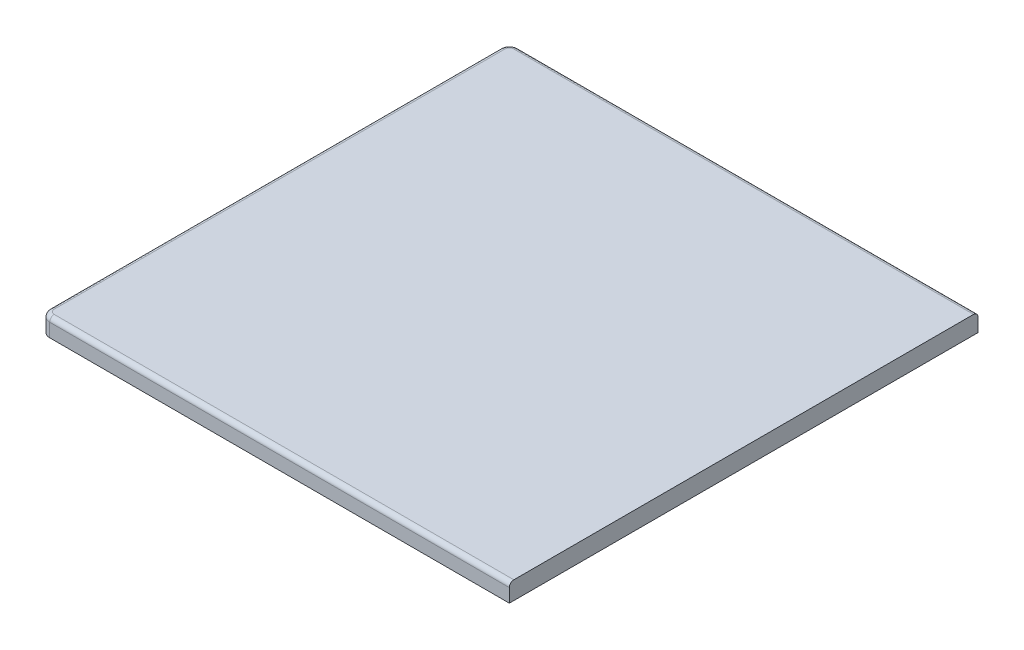
ISO-10303-21;
HEADER;
FILE_DESCRIPTION(('STEP AP214'),'2;1');
FILE_NAME('part.step','',(''),(''),'','','');
FILE_SCHEMA(('AUTOMOTIVE_DESIGN { 1 0 10303 214 1 1 1 1 }'));
ENDSEC;
DATA;
#1=APPLICATION_CONTEXT('core data for automotive mechanical design processes');
#2=APPLICATION_PROTOCOL_DEFINITION('international standard','automotive_design',2000,#1);
#3=PRODUCT_CONTEXT('',#1,'mechanical');
#4=PRODUCT('Part','Part','',(#3));
#5=PRODUCT_RELATED_PRODUCT_CATEGORY('part','',(#4));
#6=PRODUCT_DEFINITION_FORMATION('','',#4);
#7=PRODUCT_DEFINITION_CONTEXT('part definition',#1,'design');
#8=PRODUCT_DEFINITION('design','',#6,#7);
#9=PRODUCT_DEFINITION_SHAPE('','',#8);
#10=(LENGTH_UNIT() NAMED_UNIT(*) SI_UNIT(.MILLI.,.METRE.));
#11=(NAMED_UNIT(*) PLANE_ANGLE_UNIT() SI_UNIT($,.RADIAN.));
#12=(NAMED_UNIT(*) SI_UNIT($,.STERADIAN.) SOLID_ANGLE_UNIT());
#13=UNCERTAINTY_MEASURE_WITH_UNIT(LENGTH_MEASURE(1.E-05),#10,'distance_accuracy_value','');
#14=(GEOMETRIC_REPRESENTATION_CONTEXT(3) GLOBAL_UNCERTAINTY_ASSIGNED_CONTEXT((#13)) GLOBAL_UNIT_ASSIGNED_CONTEXT((#10,
#11,#12)) REPRESENTATION_CONTEXT('',''));
#15=CARTESIAN_POINT('',(0.,0.,0.));
#16=DIRECTION('',(0.,0.,1.));
#17=DIRECTION('',(1.,0.,0.));
#18=AXIS2_PLACEMENT_3D('',#15,#16,#17);
#19=CARTESIAN_POINT('',(0.,4.,0.));
#20=DIRECTION('',(0.,1.,0.));
#21=DIRECTION('',(0.,0.,1.));
#22=AXIS2_PLACEMENT_3D('',#19,#20,#21);
#23=PLANE('',#22);
#24=CARTESIAN_POINT('',(-50.,4.,-50.));
#25=DIRECTION('',(0.,1.,0.));
#26=DIRECTION('',(0.,0.,1.));
#27=AXIS2_PLACEMENT_3D('',#24,#25,#26);
#28=CIRCLE('',#27,1.);
#29=CARTESIAN_POINT('',(-51.,4.,-50.));
#30=VERTEX_POINT('',#29);
#31=CARTESIAN_POINT('',(-50.,4.,-51.));
#32=VERTEX_POINT('',#31);
#33=EDGE_CURVE('E209',#30,#32,#28,.F.);
#34=ORIENTED_EDGE('',*,*,#33,.F.);
#35=DIRECTION('',(0.,0.,1.));
#36=VECTOR('',#35,1.);
#37=CARTESIAN_POINT('',(-51.,4.,52.));
#38=LINE('',#37,#36);
#39=CARTESIAN_POINT('',(-51.,4.,50.));
#40=VERTEX_POINT('',#39);
#41=EDGE_CURVE('E187',#30,#40,#38,.T.);
#42=ORIENTED_EDGE('',*,*,#41,.T.);
#43=CARTESIAN_POINT('',(-50.,4.,50.));
#44=DIRECTION('',(0.,1.,0.));
#45=DIRECTION('',(0.,0.,1.));
#46=AXIS2_PLACEMENT_3D('',#43,#44,#45);
#47=CIRCLE('',#46,1.);
#48=CARTESIAN_POINT('',(-50.,4.,51.));
#49=VERTEX_POINT('',#48);
#50=EDGE_CURVE('E207',#49,#40,#47,.F.);
#51=ORIENTED_EDGE('',*,*,#50,.F.);
#52=DIRECTION('',(1.,0.,0.));
#53=VECTOR('',#52,1.);
#54=CARTESIAN_POINT('',(52.,4.,51.));
#55=LINE('',#54,#53);
#56=CARTESIAN_POINT('',(52.,4.,51.));
#57=VERTEX_POINT('',#56);
#58=EDGE_CURVE('E190',#49,#57,#55,.T.);
#59=ORIENTED_EDGE('',*,*,#58,.T.);
#60=DIRECTION('',(0.,0.,-1.));
#61=VECTOR('',#60,1.);
#62=CARTESIAN_POINT('',(52.,4.,52.));
#63=LINE('',#62,#61);
#64=CARTESIAN_POINT('',(52.,4.,-51.));
#65=VERTEX_POINT('',#64);
#66=EDGE_CURVE('E170',#57,#65,#63,.T.);
#67=ORIENTED_EDGE('',*,*,#66,.T.);
#68=DIRECTION('',(-1.,0.,0.));
#69=VECTOR('',#68,1.);
#70=CARTESIAN_POINT('',(-52.,4.,-51.));
#71=LINE('',#70,#69);
#72=EDGE_CURVE('E184',#65,#32,#71,.T.);
#73=ORIENTED_EDGE('',*,*,#72,.T.);
#74=EDGE_LOOP('',(#34,#42,#51,#59,#67,#73));
#75=FACE_BOUND('',#74,.T.);
#76=ADVANCED_FACE('F40',(#75),#23,.T.);
#77=CARTESIAN_POINT('',(0.,0.,0.));
#78=DIRECTION('',(0.,1.,0.));
#79=DIRECTION('',(0.,0.,1.));
#80=AXIS2_PLACEMENT_3D('',#77,#78,#79);
#81=PLANE('',#80);
#82=DIRECTION('',(1.,0.,0.));
#83=VECTOR('',#82,1.);
#84=CARTESIAN_POINT('',(52.,0.,52.));
#85=LINE('',#84,#83);
#86=CARTESIAN_POINT('',(-50.,0.,52.));
#87=VERTEX_POINT('',#86);
#88=CARTESIAN_POINT('',(52.,0.,52.));
#89=VERTEX_POINT('',#88);
#90=EDGE_CURVE('E164',#87,#89,#85,.T.);
#91=ORIENTED_EDGE('',*,*,#90,.F.);
#92=CARTESIAN_POINT('',(-50.,0.,50.));
#93=DIRECTION('',(0.,1.,0.));
#94=DIRECTION('',(0.,0.,1.));
#95=AXIS2_PLACEMENT_3D('',#92,#93,#94);
#96=CIRCLE('',#95,2.);
#97=CARTESIAN_POINT('',(-52.,0.,50.));
#98=VERTEX_POINT('',#97);
#99=EDGE_CURVE('E63',#87,#98,#96,.F.);
#100=ORIENTED_EDGE('',*,*,#99,.T.);
#101=DIRECTION('',(0.,0.,1.));
#102=VECTOR('',#101,1.);
#103=CARTESIAN_POINT('',(-52.,0.,52.));
#104=LINE('',#103,#102);
#105=CARTESIAN_POINT('',(-52.,0.,-50.));
#106=VERTEX_POINT('',#105);
#107=EDGE_CURVE('E161',#106,#98,#104,.T.);
#108=ORIENTED_EDGE('',*,*,#107,.F.);
#109=CARTESIAN_POINT('',(-50.,0.,-50.));
#110=DIRECTION('',(0.,1.,0.));
#111=DIRECTION('',(0.,0.,1.));
#112=AXIS2_PLACEMENT_3D('',#109,#110,#111);
#113=CIRCLE('',#112,2.);
#114=CARTESIAN_POINT('',(-50.,0.,-52.));
#115=VERTEX_POINT('',#114);
#116=EDGE_CURVE('E57',#106,#115,#113,.F.);
#117=ORIENTED_EDGE('',*,*,#116,.T.);
#118=DIRECTION('',(-1.,0.,0.));
#119=VECTOR('',#118,1.);
#120=CARTESIAN_POINT('',(52.,0.,-52.));
#121=LINE('',#120,#119);
#122=CARTESIAN_POINT('',(52.,0.,-52.));
#123=VERTEX_POINT('',#122);
#124=EDGE_CURVE('E173',#123,#115,#121,.T.);
#125=ORIENTED_EDGE('',*,*,#124,.F.);
#126=DIRECTION('',(0.,0.,-1.));
#127=VECTOR('',#126,1.);
#128=CARTESIAN_POINT('',(52.,0.,52.));
#129=LINE('',#128,#127);
#130=EDGE_CURVE('E176',#89,#123,#129,.T.);
#131=ORIENTED_EDGE('',*,*,#130,.F.);
#132=EDGE_LOOP('',(#91,#100,#108,#117,#125,#131));
#133=FACE_BOUND('',#132,.T.);
#134=DIRECTION('',(-1.,0.,0.));
#135=VECTOR('',#134,1.);
#136=CARTESIAN_POINT('',(50.,0.,-50.));
#137=LINE('',#136,#135);
#138=CARTESIAN_POINT('',(50.,0.,-50.));
#139=VERTEX_POINT('',#138);
#140=CARTESIAN_POINT('',(-50.,0.,-50.));
#141=VERTEX_POINT('',#140);
#142=EDGE_CURVE('E226',#139,#141,#137,.T.);
#143=ORIENTED_EDGE('',*,*,#142,.T.);
#144=DIRECTION('',(0.,0.,1.));
#145=VECTOR('',#144,1.);
#146=CARTESIAN_POINT('',(-50.,0.,-50.));
#147=LINE('',#146,#145);
#148=CARTESIAN_POINT('',(-50.,0.,50.));
#149=VERTEX_POINT('',#148);
#150=EDGE_CURVE('E160',#141,#149,#147,.T.);
#151=ORIENTED_EDGE('',*,*,#150,.T.);
#152=DIRECTION('',(1.,0.,0.));
#153=VECTOR('',#152,1.);
#154=CARTESIAN_POINT('',(-50.,0.,50.));
#155=LINE('',#154,#153);
#156=CARTESIAN_POINT('',(50.,0.,50.));
#157=VERTEX_POINT('',#156);
#158=EDGE_CURVE('E427',#149,#157,#155,.T.);
#159=ORIENTED_EDGE('',*,*,#158,.T.);
#160=DIRECTION('',(0.,0.,-1.));
#161=VECTOR('',#160,1.);
#162=CARTESIAN_POINT('',(50.,0.,50.));
#163=LINE('',#162,#161);
#164=EDGE_CURVE('E156',#157,#139,#163,.T.);
#165=ORIENTED_EDGE('',*,*,#164,.T.);
#166=EDGE_LOOP('',(#143,#151,#159,#165));
#167=FACE_BOUND('',#166,.T.);
#168=ADVANCED_FACE('F246',(#133,#167),#81,.F.);
#169=CARTESIAN_POINT('',(-52.,4.,52.));
#170=DIRECTION('',(1.,0.,0.));
#171=DIRECTION('',(0.,0.,-1.));
#172=AXIS2_PLACEMENT_3D('',#169,#170,#171);
#173=PLANE('',#172);
#174=ORIENTED_EDGE('',*,*,#107,.T.);
#175=DIRECTION('',(0.,-1.,0.));
#176=VECTOR('',#175,1.);
#177=CARTESIAN_POINT('',(-52.,4.,50.));
#178=LINE('',#177,#176);
#179=CARTESIAN_POINT('',(-52.,3.,50.));
#180=VERTEX_POINT('',#179);
#181=EDGE_CURVE('E49',#98,#180,#178,.F.);
#182=ORIENTED_EDGE('',*,*,#181,.T.);
#183=DIRECTION('',(0.,0.,1.));
#184=VECTOR('',#183,1.);
#185=CARTESIAN_POINT('',(-52.,3.,-52.));
#186=LINE('',#185,#184);
#187=CARTESIAN_POINT('',(-52.,3.,-50.));
#188=VERTEX_POINT('',#187);
#189=EDGE_CURVE('E199',#180,#188,#186,.F.);
#190=ORIENTED_EDGE('',*,*,#189,.T.);
#191=DIRECTION('',(0.,-1.,0.));
#192=VECTOR('',#191,1.);
#193=CARTESIAN_POINT('',(-52.,4.,-50.));
#194=LINE('',#193,#192);
#195=EDGE_CURVE('E222',#188,#106,#194,.T.);
#196=ORIENTED_EDGE('',*,*,#195,.T.);
#197=EDGE_LOOP('',(#174,#182,#190,#196));
#198=FACE_BOUND('',#197,.T.);
#199=ADVANCED_FACE('F265',(#198),#173,.F.);
#200=CARTESIAN_POINT('',(52.,4.,52.));
#201=DIRECTION('',(0.,0.,-1.));
#202=DIRECTION('',(-1.,0.,0.));
#203=AXIS2_PLACEMENT_3D('',#200,#201,#202);
#204=PLANE('',#203);
#205=DIRECTION('',(1.,0.,0.));
#206=VECTOR('',#205,1.);
#207=CARTESIAN_POINT('',(-52.,3.,52.));
#208=LINE('',#207,#206);
#209=CARTESIAN_POINT('',(52.,3.,52.));
#210=VERTEX_POINT('',#209);
#211=CARTESIAN_POINT('',(-50.,3.,52.));
#212=VERTEX_POINT('',#211);
#213=EDGE_CURVE('E196',#210,#212,#208,.F.);
#214=ORIENTED_EDGE('',*,*,#213,.T.);
#215=DIRECTION('',(0.,-1.,0.));
#216=VECTOR('',#215,1.);
#217=CARTESIAN_POINT('',(-50.,4.,52.));
#218=LINE('',#217,#216);
#219=EDGE_CURVE('E218',#212,#87,#218,.T.);
#220=ORIENTED_EDGE('',*,*,#219,.T.);
#221=ORIENTED_EDGE('',*,*,#90,.T.);
#222=DIRECTION('',(0.,-1.,0.));
#223=VECTOR('',#222,1.);
#224=CARTESIAN_POINT('',(52.,4.,52.));
#225=LINE('',#224,#223);
#226=EDGE_CURVE('E181',#210,#89,#225,.T.);
#227=ORIENTED_EDGE('',*,*,#226,.F.);
#228=EDGE_LOOP('',(#214,#220,#221,#227));
#229=FACE_BOUND('',#228,.T.);
#230=ADVANCED_FACE('F242',(#229),#204,.F.);
#231=CARTESIAN_POINT('',(52.,4.,52.));
#232=DIRECTION('',(-1.,0.,0.));
#233=DIRECTION('',(0.,0.,1.));
#234=AXIS2_PLACEMENT_3D('',#231,#232,#233);
#235=PLANE('',#234);
#236=ORIENTED_EDGE('',*,*,#66,.F.);
#237=CARTESIAN_POINT('',(52.,3.,51.));
#238=DIRECTION('',(-1.,0.,0.));
#239=DIRECTION('',(0.,0.,1.));
#240=AXIS2_PLACEMENT_3D('',#237,#238,#239);
#241=CIRCLE('',#240,1.);
#242=EDGE_CURVE('E194',#57,#210,#241,.F.);
#243=ORIENTED_EDGE('',*,*,#242,.T.);
#244=ORIENTED_EDGE('',*,*,#226,.T.);
#245=ORIENTED_EDGE('',*,*,#130,.T.);
#246=DIRECTION('',(0.,-1.,0.));
#247=VECTOR('',#246,1.);
#248=CARTESIAN_POINT('',(52.,4.,-52.));
#249=LINE('',#248,#247);
#250=CARTESIAN_POINT('',(52.,3.,-52.));
#251=VERTEX_POINT('',#250);
#252=EDGE_CURVE('E172',#251,#123,#249,.T.);
#253=ORIENTED_EDGE('',*,*,#252,.F.);
#254=CARTESIAN_POINT('',(52.,3.,-51.));
#255=DIRECTION('',(-1.,0.,0.));
#256=DIRECTION('',(0.,0.,1.));
#257=AXIS2_PLACEMENT_3D('',#254,#255,#256);
#258=CIRCLE('',#257,1.);
#259=EDGE_CURVE('E192',#251,#65,#258,.F.);
#260=ORIENTED_EDGE('',*,*,#259,.T.);
#261=EDGE_LOOP('',(#236,#243,#244,#245,#253,#260));
#262=FACE_BOUND('',#261,.T.);
#263=ADVANCED_FACE('F251',(#262),#235,.F.);
#264=CARTESIAN_POINT('',(52.,4.,-52.));
#265=DIRECTION('',(0.,0.,1.));
#266=DIRECTION('',(1.,0.,0.));
#267=AXIS2_PLACEMENT_3D('',#264,#265,#266);
#268=PLANE('',#267);
#269=ORIENTED_EDGE('',*,*,#124,.T.);
#270=DIRECTION('',(0.,-1.,0.));
#271=VECTOR('',#270,1.);
#272=CARTESIAN_POINT('',(-50.,4.,-52.));
#273=LINE('',#272,#271);
#274=CARTESIAN_POINT('',(-50.,3.,-52.));
#275=VERTEX_POINT('',#274);
#276=EDGE_CURVE('E11',#115,#275,#273,.F.);
#277=ORIENTED_EDGE('',*,*,#276,.T.);
#278=DIRECTION('',(-1.,0.,0.));
#279=VECTOR('',#278,1.);
#280=CARTESIAN_POINT('',(52.,3.,-52.));
#281=LINE('',#280,#279);
#282=EDGE_CURVE('E202',#275,#251,#281,.F.);
#283=ORIENTED_EDGE('',*,*,#282,.T.);
#284=ORIENTED_EDGE('',*,*,#252,.T.);
#285=EDGE_LOOP('',(#269,#277,#283,#284));
#286=FACE_BOUND('',#285,.T.);
#287=ADVANCED_FACE('F271',(#286),#268,.F.);
#288=CARTESIAN_POINT('',(50.,3.,-50.));
#289=DIRECTION('',(0.,0.,1.));
#290=DIRECTION('',(1.,0.,0.));
#291=AXIS2_PLACEMENT_3D('',#288,#289,#290);
#292=PLANE('',#291);
#293=ORIENTED_EDGE('',*,*,#142,.F.);
#294=DIRECTION('',(0.,-1.,0.));
#295=VECTOR('',#294,1.);
#296=CARTESIAN_POINT('',(50.,3.,-50.));
#297=LINE('',#296,#295);
#298=CARTESIAN_POINT('',(50.,3.,-50.));
#299=VERTEX_POINT('',#298);
#300=EDGE_CURVE('E155',#299,#139,#297,.T.);
#301=ORIENTED_EDGE('',*,*,#300,.F.);
#302=DIRECTION('',(-1.,0.,0.));
#303=VECTOR('',#302,1.);
#304=CARTESIAN_POINT('',(50.,3.,-50.));
#305=LINE('',#304,#303);
#306=CARTESIAN_POINT('',(-50.,3.,-50.));
#307=VERTEX_POINT('',#306);
#308=EDGE_CURVE('E142',#299,#307,#305,.T.);
#309=ORIENTED_EDGE('',*,*,#308,.T.);
#310=DIRECTION('',(0.,-1.,0.));
#311=VECTOR('',#310,1.);
#312=CARTESIAN_POINT('',(-50.,3.,-50.));
#313=LINE('',#312,#311);
#314=EDGE_CURVE('E152',#307,#141,#313,.T.);
#315=ORIENTED_EDGE('',*,*,#314,.T.);
#316=EDGE_LOOP('',(#293,#301,#309,#315));
#317=FACE_BOUND('',#316,.T.);
#318=ADVANCED_FACE('F151',(#317),#292,.T.);
#319=CARTESIAN_POINT('',(-50.,3.,-50.));
#320=DIRECTION('',(1.,0.,0.));
#321=DIRECTION('',(0.,0.,-1.));
#322=AXIS2_PLACEMENT_3D('',#319,#320,#321);
#323=PLANE('',#322);
#324=ORIENTED_EDGE('',*,*,#150,.F.);
#325=ORIENTED_EDGE('',*,*,#314,.F.);
#326=DIRECTION('',(0.,0.,1.));
#327=VECTOR('',#326,1.);
#328=CARTESIAN_POINT('',(-50.,3.,-50.));
#329=LINE('',#328,#327);
#330=CARTESIAN_POINT('',(-50.,3.,50.));
#331=VERTEX_POINT('',#330);
#332=EDGE_CURVE('E138',#307,#331,#329,.T.);
#333=ORIENTED_EDGE('',*,*,#332,.T.);
#334=DIRECTION('',(0.,-1.,0.));
#335=VECTOR('',#334,1.);
#336=CARTESIAN_POINT('',(-50.,3.,50.));
#337=LINE('',#336,#335);
#338=EDGE_CURVE('E162',#331,#149,#337,.T.);
#339=ORIENTED_EDGE('',*,*,#338,.T.);
#340=EDGE_LOOP('',(#324,#325,#333,#339));
#341=FACE_BOUND('',#340,.T.);
#342=ADVANCED_FACE('F158',(#341),#323,.T.);
#343=CARTESIAN_POINT('',(-50.,3.,50.));
#344=DIRECTION('',(0.,0.,-1.));
#345=DIRECTION('',(-1.,0.,0.));
#346=AXIS2_PLACEMENT_3D('',#343,#344,#345);
#347=PLANE('',#346);
#348=ORIENTED_EDGE('',*,*,#158,.F.);
#349=ORIENTED_EDGE('',*,*,#338,.F.);
#350=DIRECTION('',(1.,0.,0.));
#351=VECTOR('',#350,1.);
#352=CARTESIAN_POINT('',(-50.,3.,50.));
#353=LINE('',#352,#351);
#354=CARTESIAN_POINT('',(50.,3.,50.));
#355=VERTEX_POINT('',#354);
#356=EDGE_CURVE('E143',#331,#355,#353,.T.);
#357=ORIENTED_EDGE('',*,*,#356,.T.);
#358=DIRECTION('',(0.,-1.,0.));
#359=VECTOR('',#358,1.);
#360=CARTESIAN_POINT('',(50.,3.,50.));
#361=LINE('',#360,#359);
#362=EDGE_CURVE('E166',#355,#157,#361,.T.);
#363=ORIENTED_EDGE('',*,*,#362,.T.);
#364=EDGE_LOOP('',(#348,#349,#357,#363));
#365=FACE_BOUND('',#364,.T.);
#366=ADVANCED_FACE('F312',(#365),#347,.T.);
#367=CARTESIAN_POINT('',(50.,3.,50.));
#368=DIRECTION('',(-1.,0.,0.));
#369=DIRECTION('',(0.,0.,1.));
#370=AXIS2_PLACEMENT_3D('',#367,#368,#369);
#371=PLANE('',#370);
#372=ORIENTED_EDGE('',*,*,#164,.F.);
#373=ORIENTED_EDGE('',*,*,#362,.F.);
#374=DIRECTION('',(0.,0.,-1.));
#375=VECTOR('',#374,1.);
#376=CARTESIAN_POINT('',(50.,3.,50.));
#377=LINE('',#376,#375);
#378=EDGE_CURVE('E436',#355,#299,#377,.T.);
#379=ORIENTED_EDGE('',*,*,#378,.T.);
#380=ORIENTED_EDGE('',*,*,#300,.T.);
#381=EDGE_LOOP('',(#372,#373,#379,#380));
#382=FACE_BOUND('',#381,.T.);
#383=ADVANCED_FACE('F307',(#382),#371,.T.);
#384=CARTESIAN_POINT('',(0.,3.,0.));
#385=DIRECTION('',(0.,1.,0.));
#386=DIRECTION('',(0.,0.,1.));
#387=AXIS2_PLACEMENT_3D('',#384,#385,#386);
#388=PLANE('',#387);
#389=ORIENTED_EDGE('',*,*,#308,.F.);
#390=ORIENTED_EDGE('',*,*,#378,.F.);
#391=ORIENTED_EDGE('',*,*,#356,.F.);
#392=ORIENTED_EDGE('',*,*,#332,.F.);
#393=EDGE_LOOP('',(#389,#390,#391,#392));
#394=FACE_BOUND('',#393,.T.);
#395=ADVANCED_FACE('F140',(#394),#388,.F.);
#396=CARTESIAN_POINT('',(0.,3.,-51.));
#397=DIRECTION('',(1.,0.,0.));
#398=DIRECTION('',(0.,0.,-1.));
#399=AXIS2_PLACEMENT_3D('',#396,#397,#398);
#400=CYLINDRICAL_SURFACE('',#399,1.);
#401=ORIENTED_EDGE('',*,*,#282,.F.);
#402=CARTESIAN_POINT('',(-50.,3.,-51.));
#403=DIRECTION('',(1.,0.,0.));
#404=DIRECTION('',(0.,0.,-1.));
#405=AXIS2_PLACEMENT_3D('',#402,#403,#404);
#406=CIRCLE('',#405,1.);
#407=EDGE_CURVE('E204',#275,#32,#406,.T.);
#408=ORIENTED_EDGE('',*,*,#407,.T.);
#409=ORIENTED_EDGE('',*,*,#72,.F.);
#410=ORIENTED_EDGE('',*,*,#259,.F.);
#411=EDGE_LOOP('',(#401,#408,#409,#410));
#412=FACE_BOUND('',#411,.T.);
#413=ADVANCED_FACE('F273',(#412),#400,.T.);
#414=CARTESIAN_POINT('',(-51.,3.,0.));
#415=DIRECTION('',(0.,0.,-1.));
#416=DIRECTION('',(-1.,0.,0.));
#417=AXIS2_PLACEMENT_3D('',#414,#415,#416);
#418=CYLINDRICAL_SURFACE('',#417,1.);
#419=ORIENTED_EDGE('',*,*,#189,.F.);
#420=CARTESIAN_POINT('',(-51.,3.,50.));
#421=DIRECTION('',(0.,0.,-1.));
#422=DIRECTION('',(-1.,0.,0.));
#423=AXIS2_PLACEMENT_3D('',#420,#421,#422);
#424=CIRCLE('',#423,1.);
#425=EDGE_CURVE('E213',#180,#40,#424,.T.);
#426=ORIENTED_EDGE('',*,*,#425,.T.);
#427=ORIENTED_EDGE('',*,*,#41,.F.);
#428=CARTESIAN_POINT('',(-51.,3.,-50.));
#429=DIRECTION('',(0.,0.,1.));
#430=DIRECTION('',(1.,0.,0.));
#431=AXIS2_PLACEMENT_3D('',#428,#429,#430);
#432=CIRCLE('',#431,1.);
#433=EDGE_CURVE('E211',#30,#188,#432,.T.);
#434=ORIENTED_EDGE('',*,*,#433,.T.);
#435=EDGE_LOOP('',(#419,#426,#427,#434));
#436=FACE_BOUND('',#435,.T.);
#437=ADVANCED_FACE('F262',(#436),#418,.T.);
#438=CARTESIAN_POINT('',(0.,3.,51.));
#439=DIRECTION('',(-1.,0.,0.));
#440=DIRECTION('',(0.,0.,1.));
#441=AXIS2_PLACEMENT_3D('',#438,#439,#440);
#442=CYLINDRICAL_SURFACE('',#441,1.);
#443=ORIENTED_EDGE('',*,*,#58,.F.);
#444=CARTESIAN_POINT('',(-50.,3.,51.));
#445=DIRECTION('',(1.,0.,0.));
#446=DIRECTION('',(0.,0.,-1.));
#447=AXIS2_PLACEMENT_3D('',#444,#445,#446);
#448=CIRCLE('',#447,1.);
#449=EDGE_CURVE('E216',#49,#212,#448,.T.);
#450=ORIENTED_EDGE('',*,*,#449,.T.);
#451=ORIENTED_EDGE('',*,*,#213,.F.);
#452=ORIENTED_EDGE('',*,*,#242,.F.);
#453=EDGE_LOOP('',(#443,#450,#451,#452));
#454=FACE_BOUND('',#453,.T.);
#455=ADVANCED_FACE('F256',(#454),#442,.T.);
#456=CARTESIAN_POINT('',(-50.,4.,-50.));
#457=DIRECTION('',(0.,-1.,0.));
#458=DIRECTION('',(0.,0.,-1.));
#459=AXIS2_PLACEMENT_3D('',#456,#457,#458);
#460=CYLINDRICAL_SURFACE('',#459,2.);
#461=ORIENTED_EDGE('',*,*,#116,.F.);
#462=ORIENTED_EDGE('',*,*,#195,.F.);
#463=CARTESIAN_POINT('',(-50.,3.,-50.));
#464=DIRECTION('',(0.,1.,0.));
#465=DIRECTION('',(0.,0.,1.));
#466=AXIS2_PLACEMENT_3D('',#463,#464,#465);
#467=CIRCLE('',#466,2.);
#468=EDGE_CURVE('E224',#275,#188,#467,.T.);
#469=ORIENTED_EDGE('',*,*,#468,.F.);
#470=ORIENTED_EDGE('',*,*,#276,.F.);
#471=EDGE_LOOP('',(#461,#462,#469,#470));
#472=FACE_BOUND('',#471,.T.);
#473=ADVANCED_FACE('F267',(#472),#460,.T.);
#474=CARTESIAN_POINT('',(-50.,3.,-50.));
#475=DIRECTION('',(0.,1.,0.));
#476=DIRECTION('',(0.,0.,1.));
#477=AXIS2_PLACEMENT_3D('',#474,#475,#476);
#478=DEGENERATE_TOROIDAL_SURFACE('',#477,1.,1.,.T.);
#479=ORIENTED_EDGE('',*,*,#407,.F.);
#480=ORIENTED_EDGE('',*,*,#468,.T.);
#481=ORIENTED_EDGE('',*,*,#433,.F.);
#482=ORIENTED_EDGE('',*,*,#33,.T.);
#483=EDGE_LOOP('',(#479,#480,#481,#482));
#484=FACE_BOUND('',#483,.T.);
#485=ADVANCED_FACE('F274',(#484),#478,.T.);
#486=CARTESIAN_POINT('',(-50.,4.,50.));
#487=DIRECTION('',(0.,-1.,0.));
#488=DIRECTION('',(0.,0.,-1.));
#489=AXIS2_PLACEMENT_3D('',#486,#487,#488);
#490=CYLINDRICAL_SURFACE('',#489,2.);
#491=ORIENTED_EDGE('',*,*,#99,.F.);
#492=ORIENTED_EDGE('',*,*,#219,.F.);
#493=CARTESIAN_POINT('',(-50.,3.,50.));
#494=DIRECTION('',(0.,1.,0.));
#495=DIRECTION('',(0.,0.,1.));
#496=AXIS2_PLACEMENT_3D('',#493,#494,#495);
#497=CIRCLE('',#496,2.);
#498=EDGE_CURVE('E44',#180,#212,#497,.T.);
#499=ORIENTED_EDGE('',*,*,#498,.F.);
#500=ORIENTED_EDGE('',*,*,#181,.F.);
#501=EDGE_LOOP('',(#491,#492,#499,#500));
#502=FACE_BOUND('',#501,.T.);
#503=ADVANCED_FACE('F42',(#502),#490,.T.);
#504=CARTESIAN_POINT('',(-50.,3.,50.));
#505=DIRECTION('',(0.,1.,0.));
#506=DIRECTION('',(0.,0.,1.));
#507=AXIS2_PLACEMENT_3D('',#504,#505,#506);
#508=DEGENERATE_TOROIDAL_SURFACE('',#507,1.,1.,.T.);
#509=ORIENTED_EDGE('',*,*,#425,.F.);
#510=ORIENTED_EDGE('',*,*,#498,.T.);
#511=ORIENTED_EDGE('',*,*,#449,.F.);
#512=ORIENTED_EDGE('',*,*,#50,.T.);
#513=EDGE_LOOP('',(#509,#510,#511,#512));
#514=FACE_BOUND('',#513,.T.);
#515=ADVANCED_FACE('F237',(#514),#508,.T.);
#516=CLOSED_SHELL('',(#76,#168,#199,#230,#263,#287,#318,#342,#366,#383,#395,#413,#437,#455,#473,
#485,#503,#515));
#517=MANIFOLD_SOLID_BREP('B2',#516);
#518=ADVANCED_BREP_SHAPE_REPRESENTATION('',(#18,#517),#14);
#519=SHAPE_DEFINITION_REPRESENTATION(#9,#518);
ENDSEC;
END-ISO-10303-21;
